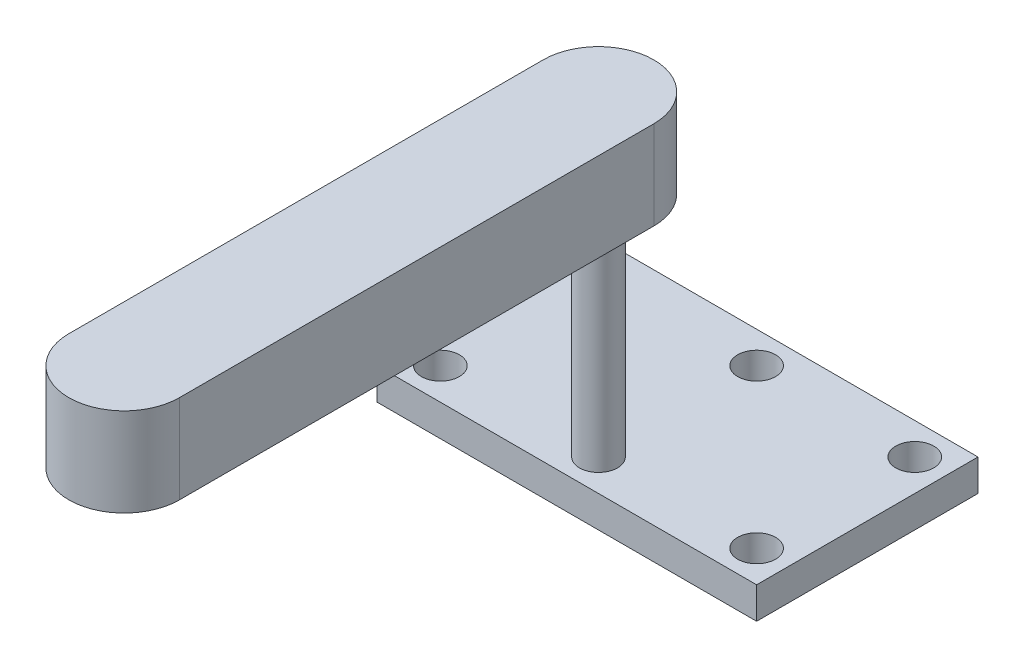
ISO-10303-21;
HEADER;
FILE_DESCRIPTION(('STEP AP214'),'2;1');
FILE_NAME('part.step','',(''),(''),'','','');
FILE_SCHEMA(('AUTOMOTIVE_DESIGN { 1 0 10303 214 1 1 1 1 }'));
ENDSEC;
DATA;
#1=APPLICATION_CONTEXT('core data for automotive mechanical design processes');
#2=APPLICATION_PROTOCOL_DEFINITION('international standard','automotive_design',2000,#1);
#3=PRODUCT_CONTEXT('',#1,'mechanical');
#4=PRODUCT('Part','Part','',(#3));
#5=PRODUCT_RELATED_PRODUCT_CATEGORY('part','',(#4));
#6=PRODUCT_DEFINITION_FORMATION('','',#4);
#7=PRODUCT_DEFINITION_CONTEXT('part definition',#1,'design');
#8=PRODUCT_DEFINITION('design','',#6,#7);
#9=PRODUCT_DEFINITION_SHAPE('','',#8);
#10=(LENGTH_UNIT() NAMED_UNIT(*) SI_UNIT(.MILLI.,.METRE.));
#11=(NAMED_UNIT(*) PLANE_ANGLE_UNIT() SI_UNIT($,.RADIAN.));
#12=(NAMED_UNIT(*) SI_UNIT($,.STERADIAN.) SOLID_ANGLE_UNIT());
#13=UNCERTAINTY_MEASURE_WITH_UNIT(LENGTH_MEASURE(1.E-05),#10,'distance_accuracy_value','');
#14=(GEOMETRIC_REPRESENTATION_CONTEXT(3) GLOBAL_UNCERTAINTY_ASSIGNED_CONTEXT((#13)) GLOBAL_UNIT_ASSIGNED_CONTEXT((#10,
#11,#12)) REPRESENTATION_CONTEXT('',''));
#15=CARTESIAN_POINT('',(0.,0.,0.));
#16=DIRECTION('',(0.,0.,1.));
#17=DIRECTION('',(1.,0.,0.));
#18=AXIS2_PLACEMENT_3D('',#15,#16,#17);
#19=CARTESIAN_POINT('',(0.,55.,0.));
#20=DIRECTION('',(0.,-1.,0.));
#21=DIRECTION('',(0.,0.,-1.));
#22=AXIS2_PLACEMENT_3D('',#19,#20,#21);
#23=CYLINDRICAL_SURFACE('',#22,3.);
#24=CARTESIAN_POINT('',(0.,5.,0.));
#25=DIRECTION('',(0.,1.,0.));
#26=DIRECTION('',(0.,0.,1.));
#27=AXIS2_PLACEMENT_3D('',#24,#25,#26);
#28=CIRCLE('',#27,3.);
#29=CARTESIAN_POINT('',(0.,5.,3.));
#30=VERTEX_POINT('',#29);
#31=EDGE_CURVE('E178',#30,#30,#28,.T.);
#32=ORIENTED_EDGE('',*,*,#31,.T.);
#33=EDGE_LOOP('',(#32));
#34=FACE_BOUND('',#33,.T.);
#35=CARTESIAN_POINT('',(0.,41.,0.));
#36=DIRECTION('',(0.,1.,0.));
#37=DIRECTION('',(0.,0.,1.));
#38=AXIS2_PLACEMENT_3D('',#35,#36,#37);
#39=CIRCLE('',#38,3.);
#40=CARTESIAN_POINT('',(0.,41.,3.));
#41=VERTEX_POINT('',#40);
#42=EDGE_CURVE('E36',#41,#41,#39,.F.);
#43=ORIENTED_EDGE('',*,*,#42,.T.);
#44=EDGE_LOOP('',(#43));
#45=FACE_BOUND('',#44,.T.);
#46=ADVANCED_FACE('F32',(#34,#45),#23,.T.);
#47=CARTESIAN_POINT('',(0.,5.,0.));
#48=DIRECTION('',(0.,1.,0.));
#49=DIRECTION('',(0.,0.,1.));
#50=AXIS2_PLACEMENT_3D('',#47,#48,#49);
#51=PLANE('',#50);
#52=CARTESIAN_POINT('',(25.,5.,-25.));
#53=DIRECTION('',(0.,1.,0.));
#54=DIRECTION('',(0.,0.,1.));
#55=AXIS2_PLACEMENT_3D('',#52,#53,#54);
#56=CIRCLE('',#55,3.);
#57=CARTESIAN_POINT('',(25.,5.,-22.));
#58=VERTEX_POINT('',#57);
#59=EDGE_CURVE('E157',#58,#58,#56,.T.);
#60=ORIENTED_EDGE('',*,*,#59,.F.);
#61=EDGE_LOOP('',(#60));
#62=FACE_BOUND('',#61,.T.);
#63=CARTESIAN_POINT('',(-25.,5.,0.));
#64=DIRECTION('',(0.,1.,0.));
#65=DIRECTION('',(0.,0.,1.));
#66=AXIS2_PLACEMENT_3D('',#63,#64,#65);
#67=CIRCLE('',#66,3.);
#68=CARTESIAN_POINT('',(-25.,5.,3.));
#69=VERTEX_POINT('',#68);
#70=EDGE_CURVE('E169',#69,#69,#67,.T.);
#71=ORIENTED_EDGE('',*,*,#70,.F.);
#72=EDGE_LOOP('',(#71));
#73=FACE_BOUND('',#72,.T.);
#74=ORIENTED_EDGE('',*,*,#31,.F.);
#75=EDGE_LOOP('',(#74));
#76=FACE_BOUND('',#75,.T.);
#77=DIRECTION('',(0.,0.,1.));
#78=VECTOR('',#77,1.);
#79=CARTESIAN_POINT('',(-30.,5.,-30.));
#80=LINE('',#79,#78);
#81=CARTESIAN_POINT('',(-30.,5.,-30.));
#82=VERTEX_POINT('',#81);
#83=CARTESIAN_POINT('',(-30.,5.,5.));
#84=VERTEX_POINT('',#83);
#85=EDGE_CURVE('E184',#82,#84,#80,.T.);
#86=ORIENTED_EDGE('',*,*,#85,.T.);
#87=DIRECTION('',(1.,0.,0.));
#88=VECTOR('',#87,1.);
#89=CARTESIAN_POINT('',(-30.,5.,5.));
#90=LINE('',#89,#88);
#91=CARTESIAN_POINT('',(30.,5.,5.));
#92=VERTEX_POINT('',#91);
#93=EDGE_CURVE('E81',#84,#92,#90,.T.);
#94=ORIENTED_EDGE('',*,*,#93,.T.);
#95=DIRECTION('',(0.,0.,-1.));
#96=VECTOR('',#95,1.);
#97=CARTESIAN_POINT('',(30.,5.,-30.));
#98=LINE('',#97,#96);
#99=CARTESIAN_POINT('',(30.,5.,-30.));
#100=VERTEX_POINT('',#99);
#101=EDGE_CURVE('E187',#92,#100,#98,.T.);
#102=ORIENTED_EDGE('',*,*,#101,.T.);
#103=DIRECTION('',(-1.,0.,0.));
#104=VECTOR('',#103,1.);
#105=CARTESIAN_POINT('',(-30.,5.,-30.));
#106=LINE('',#105,#104);
#107=EDGE_CURVE('E50',#100,#82,#106,.T.);
#108=ORIENTED_EDGE('',*,*,#107,.T.);
#109=EDGE_LOOP('',(#86,#94,#102,#108));
#110=FACE_BOUND('',#109,.T.);
#111=CARTESIAN_POINT('',(25.,5.,0.));
#112=DIRECTION('',(0.,1.,0.));
#113=DIRECTION('',(0.,0.,1.));
#114=AXIS2_PLACEMENT_3D('',#111,#112,#113);
#115=CIRCLE('',#114,3.);
#116=CARTESIAN_POINT('',(25.,5.,3.));
#117=VERTEX_POINT('',#116);
#118=EDGE_CURVE('E175',#117,#117,#115,.T.);
#119=ORIENTED_EDGE('',*,*,#118,.F.);
#120=EDGE_LOOP('',(#119));
#121=FACE_BOUND('',#120,.T.);
#122=CARTESIAN_POINT('',(0.,5.,-25.));
#123=DIRECTION('',(0.,1.,0.));
#124=DIRECTION('',(0.,0.,1.));
#125=AXIS2_PLACEMENT_3D('',#122,#123,#124);
#126=CIRCLE('',#125,3.);
#127=CARTESIAN_POINT('',(0.,5.,-22.));
#128=VERTEX_POINT('',#127);
#129=EDGE_CURVE('E163',#128,#128,#126,.T.);
#130=ORIENTED_EDGE('',*,*,#129,.F.);
#131=EDGE_LOOP('',(#130));
#132=FACE_BOUND('',#131,.T.);
#133=CARTESIAN_POINT('',(-25.,5.,-25.));
#134=DIRECTION('',(0.,1.,0.));
#135=DIRECTION('',(0.,0.,1.));
#136=AXIS2_PLACEMENT_3D('',#133,#134,#135);
#137=CIRCLE('',#136,3.);
#138=CARTESIAN_POINT('',(-25.,5.,-22.));
#139=VERTEX_POINT('',#138);
#140=EDGE_CURVE('E150',#139,#139,#137,.T.);
#141=ORIENTED_EDGE('',*,*,#140,.F.);
#142=EDGE_LOOP('',(#141));
#143=FACE_BOUND('',#142,.T.);
#144=ADVANCED_FACE('F224',(#62,#73,#76,#110,#121,#132,#143),#51,.T.);
#145=CARTESIAN_POINT('',(0.,0.,0.));
#146=DIRECTION('',(0.,1.,0.));
#147=DIRECTION('',(0.,0.,1.));
#148=AXIS2_PLACEMENT_3D('',#145,#146,#147);
#149=PLANE('',#148);
#150=DIRECTION('',(0.,0.,1.));
#151=VECTOR('',#150,1.);
#152=CARTESIAN_POINT('',(-30.,0.,-30.));
#153=LINE('',#152,#151);
#154=CARTESIAN_POINT('',(-30.,0.,-30.));
#155=VERTEX_POINT('',#154);
#156=CARTESIAN_POINT('',(-30.,0.,5.));
#157=VERTEX_POINT('',#156);
#158=EDGE_CURVE('E183',#155,#157,#153,.T.);
#159=ORIENTED_EDGE('',*,*,#158,.F.);
#160=DIRECTION('',(-1.,0.,0.));
#161=VECTOR('',#160,1.);
#162=CARTESIAN_POINT('',(-30.,0.,-30.));
#163=LINE('',#162,#161);
#164=CARTESIAN_POINT('',(30.,0.,-30.));
#165=VERTEX_POINT('',#164);
#166=EDGE_CURVE('E74',#165,#155,#163,.T.);
#167=ORIENTED_EDGE('',*,*,#166,.F.);
#168=DIRECTION('',(0.,0.,-1.));
#169=VECTOR('',#168,1.);
#170=CARTESIAN_POINT('',(30.,0.,-30.));
#171=LINE('',#170,#169);
#172=CARTESIAN_POINT('',(30.,0.,5.));
#173=VERTEX_POINT('',#172);
#174=EDGE_CURVE('E68',#173,#165,#171,.T.);
#175=ORIENTED_EDGE('',*,*,#174,.F.);
#176=DIRECTION('',(1.,0.,0.));
#177=VECTOR('',#176,1.);
#178=CARTESIAN_POINT('',(-30.,0.,5.));
#179=LINE('',#178,#177);
#180=EDGE_CURVE('E193',#157,#173,#179,.T.);
#181=ORIENTED_EDGE('',*,*,#180,.F.);
#182=EDGE_LOOP('',(#159,#167,#175,#181));
#183=FACE_BOUND('',#182,.T.);
#184=CARTESIAN_POINT('',(25.,0.,0.));
#185=DIRECTION('',(0.,1.,0.));
#186=DIRECTION('',(0.,0.,1.));
#187=AXIS2_PLACEMENT_3D('',#184,#185,#186);
#188=CIRCLE('',#187,3.);
#189=CARTESIAN_POINT('',(25.,0.,3.));
#190=VERTEX_POINT('',#189);
#191=EDGE_CURVE('E172',#190,#190,#188,.T.);
#192=ORIENTED_EDGE('',*,*,#191,.T.);
#193=EDGE_LOOP('',(#192));
#194=FACE_BOUND('',#193,.T.);
#195=CARTESIAN_POINT('',(-25.,0.,0.));
#196=DIRECTION('',(0.,1.,0.));
#197=DIRECTION('',(0.,0.,1.));
#198=AXIS2_PLACEMENT_3D('',#195,#196,#197);
#199=CIRCLE('',#198,3.);
#200=CARTESIAN_POINT('',(-25.,0.,3.));
#201=VERTEX_POINT('',#200);
#202=EDGE_CURVE('E166',#201,#201,#199,.T.);
#203=ORIENTED_EDGE('',*,*,#202,.T.);
#204=EDGE_LOOP('',(#203));
#205=FACE_BOUND('',#204,.T.);
#206=CARTESIAN_POINT('',(0.,0.,-25.));
#207=DIRECTION('',(0.,1.,0.));
#208=DIRECTION('',(0.,0.,1.));
#209=AXIS2_PLACEMENT_3D('',#206,#207,#208);
#210=CIRCLE('',#209,3.);
#211=CARTESIAN_POINT('',(0.,0.,-22.));
#212=VERTEX_POINT('',#211);
#213=EDGE_CURVE('E160',#212,#212,#210,.T.);
#214=ORIENTED_EDGE('',*,*,#213,.T.);
#215=EDGE_LOOP('',(#214));
#216=FACE_BOUND('',#215,.T.);
#217=CARTESIAN_POINT('',(25.,0.,-25.));
#218=DIRECTION('',(0.,1.,0.));
#219=DIRECTION('',(0.,0.,1.));
#220=AXIS2_PLACEMENT_3D('',#217,#218,#219);
#221=CIRCLE('',#220,3.);
#222=CARTESIAN_POINT('',(25.,0.,-22.));
#223=VERTEX_POINT('',#222);
#224=EDGE_CURVE('E153',#223,#223,#221,.T.);
#225=ORIENTED_EDGE('',*,*,#224,.T.);
#226=EDGE_LOOP('',(#225));
#227=FACE_BOUND('',#226,.T.);
#228=CARTESIAN_POINT('',(-25.,0.,-25.));
#229=DIRECTION('',(0.,1.,0.));
#230=DIRECTION('',(0.,0.,1.));
#231=AXIS2_PLACEMENT_3D('',#228,#229,#230);
#232=CIRCLE('',#231,3.);
#233=CARTESIAN_POINT('',(-25.,0.,-22.));
#234=VERTEX_POINT('',#233);
#235=EDGE_CURVE('E154',#234,#234,#232,.T.);
#236=ORIENTED_EDGE('',*,*,#235,.T.);
#237=EDGE_LOOP('',(#236));
#238=FACE_BOUND('',#237,.T.);
#239=ADVANCED_FACE('F204',(#183,#194,#205,#216,#227,#238),#149,.F.);
#240=CARTESIAN_POINT('',(-30.,5.,-30.));
#241=DIRECTION('',(1.,0.,0.));
#242=DIRECTION('',(0.,0.,-1.));
#243=AXIS2_PLACEMENT_3D('',#240,#241,#242);
#244=PLANE('',#243);
#245=ORIENTED_EDGE('',*,*,#158,.T.);
#246=DIRECTION('',(0.,-1.,0.));
#247=VECTOR('',#246,1.);
#248=CARTESIAN_POINT('',(-30.,5.,5.));
#249=LINE('',#248,#247);
#250=EDGE_CURVE('E11',#84,#157,#249,.T.);
#251=ORIENTED_EDGE('',*,*,#250,.F.);
#252=ORIENTED_EDGE('',*,*,#85,.F.);
#253=DIRECTION('',(0.,-1.,0.));
#254=VECTOR('',#253,1.);
#255=CARTESIAN_POINT('',(-30.,5.,-30.));
#256=LINE('',#255,#254);
#257=EDGE_CURVE('E190',#82,#155,#256,.T.);
#258=ORIENTED_EDGE('',*,*,#257,.T.);
#259=EDGE_LOOP('',(#245,#251,#252,#258));
#260=FACE_BOUND('',#259,.T.);
#261=ADVANCED_FACE('F34',(#260),#244,.F.);
#262=CARTESIAN_POINT('',(-30.,5.,5.));
#263=DIRECTION('',(0.,0.,-1.));
#264=DIRECTION('',(-1.,0.,0.));
#265=AXIS2_PLACEMENT_3D('',#262,#263,#264);
#266=PLANE('',#265);
#267=ORIENTED_EDGE('',*,*,#180,.T.);
#268=DIRECTION('',(0.,-1.,0.));
#269=VECTOR('',#268,1.);
#270=CARTESIAN_POINT('',(30.,5.,5.));
#271=LINE('',#270,#269);
#272=EDGE_CURVE('E42',#92,#173,#271,.T.);
#273=ORIENTED_EDGE('',*,*,#272,.F.);
#274=ORIENTED_EDGE('',*,*,#93,.F.);
#275=ORIENTED_EDGE('',*,*,#250,.T.);
#276=EDGE_LOOP('',(#267,#273,#274,#275));
#277=FACE_BOUND('',#276,.T.);
#278=ADVANCED_FACE('F220',(#277),#266,.F.);
#279=CARTESIAN_POINT('',(30.,5.,-30.));
#280=DIRECTION('',(-1.,0.,0.));
#281=DIRECTION('',(0.,0.,1.));
#282=AXIS2_PLACEMENT_3D('',#279,#280,#281);
#283=PLANE('',#282);
#284=ORIENTED_EDGE('',*,*,#174,.T.);
#285=DIRECTION('',(0.,-1.,0.));
#286=VECTOR('',#285,1.);
#287=CARTESIAN_POINT('',(30.,5.,-30.));
#288=LINE('',#287,#286);
#289=EDGE_CURVE('E198',#100,#165,#288,.T.);
#290=ORIENTED_EDGE('',*,*,#289,.F.);
#291=ORIENTED_EDGE('',*,*,#101,.F.);
#292=ORIENTED_EDGE('',*,*,#272,.T.);
#293=EDGE_LOOP('',(#284,#290,#291,#292));
#294=FACE_BOUND('',#293,.T.);
#295=ADVANCED_FACE('F201',(#294),#283,.F.);
#296=CARTESIAN_POINT('',(-30.,5.,-30.));
#297=DIRECTION('',(0.,0.,1.));
#298=DIRECTION('',(1.,0.,0.));
#299=AXIS2_PLACEMENT_3D('',#296,#297,#298);
#300=PLANE('',#299);
#301=ORIENTED_EDGE('',*,*,#166,.T.);
#302=ORIENTED_EDGE('',*,*,#257,.F.);
#303=ORIENTED_EDGE('',*,*,#107,.F.);
#304=ORIENTED_EDGE('',*,*,#289,.T.);
#305=EDGE_LOOP('',(#301,#302,#303,#304));
#306=FACE_BOUND('',#305,.T.);
#307=ADVANCED_FACE('F209',(#306),#300,.F.);
#308=CARTESIAN_POINT('',(25.,5.,0.));
#309=DIRECTION('',(0.,-1.,0.));
#310=DIRECTION('',(0.,0.,-1.));
#311=AXIS2_PLACEMENT_3D('',#308,#309,#310);
#312=CYLINDRICAL_SURFACE('',#311,3.);
#313=ORIENTED_EDGE('',*,*,#118,.T.);
#314=EDGE_LOOP('',(#313));
#315=FACE_BOUND('',#314,.T.);
#316=ORIENTED_EDGE('',*,*,#191,.F.);
#317=EDGE_LOOP('',(#316));
#318=FACE_BOUND('',#317,.T.);
#319=ADVANCED_FACE('F211',(#315,#318),#312,.F.);
#320=CARTESIAN_POINT('',(-25.,5.,0.));
#321=DIRECTION('',(0.,-1.,0.));
#322=DIRECTION('',(0.,0.,-1.));
#323=AXIS2_PLACEMENT_3D('',#320,#321,#322);
#324=CYLINDRICAL_SURFACE('',#323,3.);
#325=ORIENTED_EDGE('',*,*,#70,.T.);
#326=EDGE_LOOP('',(#325));
#327=FACE_BOUND('',#326,.T.);
#328=ORIENTED_EDGE('',*,*,#202,.F.);
#329=EDGE_LOOP('',(#328));
#330=FACE_BOUND('',#329,.T.);
#331=ADVANCED_FACE('F217',(#327,#330),#324,.F.);
#332=CARTESIAN_POINT('',(0.,5.,-25.));
#333=DIRECTION('',(0.,-1.,0.));
#334=DIRECTION('',(0.,0.,-1.));
#335=AXIS2_PLACEMENT_3D('',#332,#333,#334);
#336=CYLINDRICAL_SURFACE('',#335,3.);
#337=ORIENTED_EDGE('',*,*,#129,.T.);
#338=EDGE_LOOP('',(#337));
#339=FACE_BOUND('',#338,.T.);
#340=ORIENTED_EDGE('',*,*,#213,.F.);
#341=EDGE_LOOP('',(#340));
#342=FACE_BOUND('',#341,.T.);
#343=ADVANCED_FACE('F244',(#339,#342),#336,.F.);
#344=CARTESIAN_POINT('',(25.,5.,-25.));
#345=DIRECTION('',(0.,-1.,0.));
#346=DIRECTION('',(0.,0.,-1.));
#347=AXIS2_PLACEMENT_3D('',#344,#345,#346);
#348=CYLINDRICAL_SURFACE('',#347,3.);
#349=ORIENTED_EDGE('',*,*,#59,.T.);
#350=EDGE_LOOP('',(#349));
#351=FACE_BOUND('',#350,.T.);
#352=ORIENTED_EDGE('',*,*,#224,.F.);
#353=EDGE_LOOP('',(#352));
#354=FACE_BOUND('',#353,.T.);
#355=ADVANCED_FACE('F240',(#351,#354),#348,.F.);
#356=CARTESIAN_POINT('',(-25.,5.,-25.));
#357=DIRECTION('',(0.,-1.,0.));
#358=DIRECTION('',(0.,0.,-1.));
#359=AXIS2_PLACEMENT_3D('',#356,#357,#358);
#360=CYLINDRICAL_SURFACE('',#359,3.);
#361=ORIENTED_EDGE('',*,*,#140,.T.);
#362=EDGE_LOOP('',(#361));
#363=FACE_BOUND('',#362,.T.);
#364=ORIENTED_EDGE('',*,*,#235,.F.);
#365=EDGE_LOOP('',(#364));
#366=FACE_BOUND('',#365,.T.);
#367=ADVANCED_FACE('F237',(#363,#366),#360,.F.);
#368=CARTESIAN_POINT('',(0.,41.,0.));
#369=DIRECTION('',(0.,1.,0.));
#370=DIRECTION('',(0.,0.,1.));
#371=AXIS2_PLACEMENT_3D('',#368,#369,#370);
#372=CYLINDRICAL_SURFACE('',#371,8.75);
#373=CARTESIAN_POINT('',(0.,55.,0.));
#374=DIRECTION('',(0.,1.,0.));
#375=DIRECTION('',(0.,0.,1.));
#376=AXIS2_PLACEMENT_3D('',#373,#374,#375);
#377=CIRCLE('',#376,8.75);
#378=CARTESIAN_POINT('',(8.75,55.,0.));
#379=VERTEX_POINT('',#378);
#380=CARTESIAN_POINT('',(-8.75,55.,0.));
#381=VERTEX_POINT('',#380);
#382=EDGE_CURVE('E141',#379,#381,#377,.T.);
#383=ORIENTED_EDGE('',*,*,#382,.F.);
#384=DIRECTION('',(0.,1.,0.));
#385=VECTOR('',#384,1.);
#386=CARTESIAN_POINT('',(8.75,41.,0.));
#387=LINE('',#386,#385);
#388=CARTESIAN_POINT('',(8.75,41.,0.));
#389=VERTEX_POINT('',#388);
#390=EDGE_CURVE('E132',#389,#379,#387,.T.);
#391=ORIENTED_EDGE('',*,*,#390,.F.);
#392=CARTESIAN_POINT('',(0.,41.,0.));
#393=DIRECTION('',(0.,1.,0.));
#394=DIRECTION('',(0.,0.,1.));
#395=AXIS2_PLACEMENT_3D('',#392,#393,#394);
#396=CIRCLE('',#395,8.75);
#397=CARTESIAN_POINT('',(-8.75,41.,0.));
#398=VERTEX_POINT('',#397);
#399=EDGE_CURVE('E126',#389,#398,#396,.T.);
#400=ORIENTED_EDGE('',*,*,#399,.T.);
#401=DIRECTION('',(0.,1.,0.));
#402=VECTOR('',#401,1.);
#403=CARTESIAN_POINT('',(-8.75,41.,0.));
#404=LINE('',#403,#402);
#405=EDGE_CURVE('E108',#398,#381,#404,.T.);
#406=ORIENTED_EDGE('',*,*,#405,.T.);
#407=EDGE_LOOP('',(#383,#391,#400,#406));
#408=FACE_BOUND('',#407,.T.);
#409=ADVANCED_FACE('F131',(#408),#372,.T.);
#410=CARTESIAN_POINT('',(8.75,41.,0.));
#411=DIRECTION('',(1.,0.,0.));
#412=DIRECTION('',(0.,0.,-1.));
#413=AXIS2_PLACEMENT_3D('',#410,#411,#412);
#414=PLANE('',#413);
#415=DIRECTION('',(0.,0.,-1.));
#416=VECTOR('',#415,1.);
#417=CARTESIAN_POINT('',(8.75,55.,0.));
#418=LINE('',#417,#416);
#419=CARTESIAN_POINT('',(8.75000000000001,55.,75.));
#420=VERTEX_POINT('',#419);
#421=EDGE_CURVE('E133',#420,#379,#418,.T.);
#422=ORIENTED_EDGE('',*,*,#421,.F.);
#423=DIRECTION('',(0.,1.,0.));
#424=VECTOR('',#423,1.);
#425=CARTESIAN_POINT('',(8.75000000000001,41.,75.));
#426=LINE('',#425,#424);
#427=CARTESIAN_POINT('',(8.75000000000001,41.,75.));
#428=VERTEX_POINT('',#427);
#429=EDGE_CURVE('E147',#428,#420,#426,.T.);
#430=ORIENTED_EDGE('',*,*,#429,.F.);
#431=DIRECTION('',(0.,0.,-1.));
#432=VECTOR('',#431,1.);
#433=CARTESIAN_POINT('',(8.75,41.,0.));
#434=LINE('',#433,#432);
#435=EDGE_CURVE('E119',#428,#389,#434,.T.);
#436=ORIENTED_EDGE('',*,*,#435,.T.);
#437=ORIENTED_EDGE('',*,*,#390,.T.);
#438=EDGE_LOOP('',(#422,#430,#436,#437));
#439=FACE_BOUND('',#438,.T.);
#440=ADVANCED_FACE('F317',(#439),#414,.T.);
#441=CARTESIAN_POINT('',(0.,41.,75.));
#442=DIRECTION('',(0.,1.,0.));
#443=DIRECTION('',(0.,0.,1.));
#444=AXIS2_PLACEMENT_3D('',#441,#442,#443);
#445=CYLINDRICAL_SURFACE('',#444,8.75);
#446=CARTESIAN_POINT('',(0.,55.,75.));
#447=DIRECTION('',(0.,1.,0.));
#448=DIRECTION('',(0.,0.,1.));
#449=AXIS2_PLACEMENT_3D('',#446,#447,#448);
#450=CIRCLE('',#449,8.75);
#451=CARTESIAN_POINT('',(-8.74999999999999,55.,75.));
#452=VERTEX_POINT('',#451);
#453=EDGE_CURVE('E136',#452,#420,#450,.T.);
#454=ORIENTED_EDGE('',*,*,#453,.F.);
#455=DIRECTION('',(0.,1.,0.));
#456=VECTOR('',#455,1.);
#457=CARTESIAN_POINT('',(-8.74999999999999,41.,75.));
#458=LINE('',#457,#456);
#459=CARTESIAN_POINT('',(-8.74999999999999,41.,75.));
#460=VERTEX_POINT('',#459);
#461=EDGE_CURVE('E118',#460,#452,#458,.T.);
#462=ORIENTED_EDGE('',*,*,#461,.F.);
#463=CARTESIAN_POINT('',(0.,41.,75.));
#464=DIRECTION('',(0.,1.,0.));
#465=DIRECTION('',(0.,0.,1.));
#466=AXIS2_PLACEMENT_3D('',#463,#464,#465);
#467=CIRCLE('',#466,8.75);
#468=EDGE_CURVE('E129',#460,#428,#467,.T.);
#469=ORIENTED_EDGE('',*,*,#468,.T.);
#470=ORIENTED_EDGE('',*,*,#429,.T.);
#471=EDGE_LOOP('',(#454,#462,#469,#470));
#472=FACE_BOUND('',#471,.T.);
#473=ADVANCED_FACE('F325',(#472),#445,.T.);
#474=CARTESIAN_POINT('',(-8.75,41.,0.));
#475=DIRECTION('',(-1.,0.,0.));
#476=DIRECTION('',(0.,0.,1.));
#477=AXIS2_PLACEMENT_3D('',#474,#475,#476);
#478=PLANE('',#477);
#479=DIRECTION('',(0.,0.,1.));
#480=VECTOR('',#479,1.);
#481=CARTESIAN_POINT('',(-8.75,55.,0.));
#482=LINE('',#481,#480);
#483=EDGE_CURVE('E113',#381,#452,#482,.T.);
#484=ORIENTED_EDGE('',*,*,#483,.F.);
#485=ORIENTED_EDGE('',*,*,#405,.F.);
#486=DIRECTION('',(0.,0.,1.));
#487=VECTOR('',#486,1.);
#488=CARTESIAN_POINT('',(-8.75,41.,0.));
#489=LINE('',#488,#487);
#490=EDGE_CURVE('E111',#398,#460,#489,.T.);
#491=ORIENTED_EDGE('',*,*,#490,.T.);
#492=ORIENTED_EDGE('',*,*,#461,.T.);
#493=EDGE_LOOP('',(#484,#485,#491,#492));
#494=FACE_BOUND('',#493,.T.);
#495=ADVANCED_FACE('F110',(#494),#478,.T.);
#496=CARTESIAN_POINT('',(0.,41.,0.));
#497=DIRECTION('',(0.,1.,0.));
#498=DIRECTION('',(0.,0.,1.));
#499=AXIS2_PLACEMENT_3D('',#496,#497,#498);
#500=PLANE('',#499);
#501=ORIENTED_EDGE('',*,*,#42,.F.);
#502=EDGE_LOOP('',(#501));
#503=FACE_BOUND('',#502,.T.);
#504=ORIENTED_EDGE('',*,*,#399,.F.);
#505=ORIENTED_EDGE('',*,*,#435,.F.);
#506=ORIENTED_EDGE('',*,*,#468,.F.);
#507=ORIENTED_EDGE('',*,*,#490,.F.);
#508=EDGE_LOOP('',(#504,#505,#506,#507));
#509=FACE_BOUND('',#508,.T.);
#510=ADVANCED_FACE('F124',(#503,#509),#500,.F.);
#511=CARTESIAN_POINT('',(0.,55.,0.));
#512=DIRECTION('',(0.,-1.,0.));
#513=DIRECTION('',(0.,0.,-1.));
#514=AXIS2_PLACEMENT_3D('',#511,#512,#513);
#515=PLANE('',#514);
#516=ORIENTED_EDGE('',*,*,#382,.T.);
#517=ORIENTED_EDGE('',*,*,#483,.T.);
#518=ORIENTED_EDGE('',*,*,#453,.T.);
#519=ORIENTED_EDGE('',*,*,#421,.T.);
#520=EDGE_LOOP('',(#516,#517,#518,#519));
#521=FACE_BOUND('',#520,.T.);
#522=ADVANCED_FACE('F235',(#521),#515,.F.);
#523=CLOSED_SHELL('',(#46,#144,#239,#261,#278,#295,#307,#319,#331,#343,#355,#367,#409,#440,#473,
#495,#510,#522));
#524=MANIFOLD_SOLID_BREP('B2',#523);
#525=ADVANCED_BREP_SHAPE_REPRESENTATION('',(#18,#524),#14);
#526=SHAPE_DEFINITION_REPRESENTATION(#9,#525);
ENDSEC;
END-ISO-10303-21;
